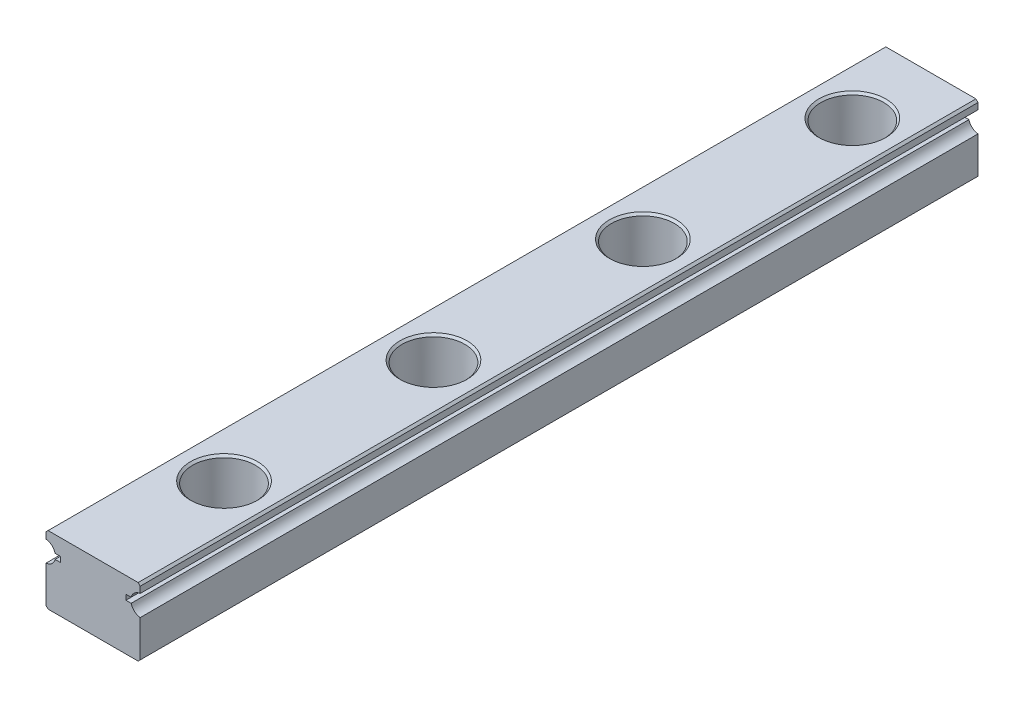
ISO-10303-21;
HEADER;
FILE_DESCRIPTION(('STEP AP214'),'2;1');
FILE_NAME('part.step','',(''),(''),'','','');
FILE_SCHEMA(('AUTOMOTIVE_DESIGN { 1 0 10303 214 1 1 1 1 }'));
ENDSEC;
DATA;
#1=APPLICATION_CONTEXT('core data for automotive mechanical design processes');
#2=APPLICATION_PROTOCOL_DEFINITION('international standard','automotive_design',2000,#1);
#3=PRODUCT_CONTEXT('',#1,'mechanical');
#4=PRODUCT('Part','Part','',(#3));
#5=PRODUCT_RELATED_PRODUCT_CATEGORY('part','',(#4));
#6=PRODUCT_DEFINITION_FORMATION('','',#4);
#7=PRODUCT_DEFINITION_CONTEXT('part definition',#1,'design');
#8=PRODUCT_DEFINITION('design','',#6,#7);
#9=PRODUCT_DEFINITION_SHAPE('','',#8);
#10=(LENGTH_UNIT() NAMED_UNIT(*) SI_UNIT(.MILLI.,.METRE.));
#11=(NAMED_UNIT(*) PLANE_ANGLE_UNIT() SI_UNIT($,.RADIAN.));
#12=(NAMED_UNIT(*) SI_UNIT($,.STERADIAN.) SOLID_ANGLE_UNIT());
#13=UNCERTAINTY_MEASURE_WITH_UNIT(LENGTH_MEASURE(1.E-05),#10,'distance_accuracy_value','');
#14=(GEOMETRIC_REPRESENTATION_CONTEXT(3) GLOBAL_UNCERTAINTY_ASSIGNED_CONTEXT((#13)) GLOBAL_UNIT_ASSIGNED_CONTEXT((#10,
#11,#12)) REPRESENTATION_CONTEXT('',''));
#15=CARTESIAN_POINT('',(0.,0.,0.));
#16=DIRECTION('',(0.,0.,1.));
#17=DIRECTION('',(1.,0.,0.));
#18=AXIS2_PLACEMENT_3D('',#15,#16,#17);
#19=CARTESIAN_POINT('',(-4.6,1.45,80.));
#20=DIRECTION('',(0.,0.,-1.));
#21=DIRECTION('',(-1.,0.,0.));
#22=AXIS2_PLACEMENT_3D('',#19,#20,#21);
#23=CYLINDRICAL_SURFACE('',#22,1.);
#24=CARTESIAN_POINT('',(-4.6,1.45,0.));
#25=DIRECTION('',(0.,0.,-1.));
#26=DIRECTION('',(-1.,0.,0.));
#27=AXIS2_PLACEMENT_3D('',#24,#25,#26);
#28=CIRCLE('',#27,1.);
#29=CARTESIAN_POINT('',(-4.5,2.44498743710662,0.));
#30=VERTEX_POINT('',#29);
#31=CARTESIAN_POINT('',(-3.63175416344814,1.7,0.));
#32=VERTEX_POINT('',#31);
#33=EDGE_CURVE('E214',#30,#32,#28,.T.);
#34=ORIENTED_EDGE('',*,*,#33,.T.);
#35=DIRECTION('',(0.,0.,-1.));
#36=VECTOR('',#35,1.);
#37=CARTESIAN_POINT('',(-3.63175416344814,1.7,80.));
#38=LINE('',#37,#36);
#39=CARTESIAN_POINT('',(-3.63175416344814,1.7,80.));
#40=VERTEX_POINT('',#39);
#41=EDGE_CURVE('E340',#40,#32,#38,.T.);
#42=ORIENTED_EDGE('',*,*,#41,.F.);
#43=CARTESIAN_POINT('',(-4.6,1.45,80.));
#44=DIRECTION('',(0.,0.,-1.));
#45=DIRECTION('',(-1.,0.,0.));
#46=AXIS2_PLACEMENT_3D('',#43,#44,#45);
#47=CIRCLE('',#46,1.);
#48=CARTESIAN_POINT('',(-4.5,2.44498743710662,80.));
#49=VERTEX_POINT('',#48);
#50=EDGE_CURVE('E273',#49,#40,#47,.T.);
#51=ORIENTED_EDGE('',*,*,#50,.F.);
#52=DIRECTION('',(0.,0.,-1.));
#53=VECTOR('',#52,1.);
#54=CARTESIAN_POINT('',(-4.5,2.44498743710662,80.));
#55=LINE('',#54,#53);
#56=EDGE_CURVE('E210',#49,#30,#55,.T.);
#57=ORIENTED_EDGE('',*,*,#56,.T.);
#58=EDGE_LOOP('',(#34,#42,#51,#57));
#59=FACE_BOUND('',#58,.T.);
#60=ADVANCED_FACE('F39',(#59),#23,.F.);
#61=CARTESIAN_POINT('',(-3.63175416344814,1.7,80.));
#62=DIRECTION('',(0.,1.,0.));
#63=DIRECTION('',(0.,0.,1.));
#64=AXIS2_PLACEMENT_3D('',#61,#62,#63);
#65=PLANE('',#64);
#66=DIRECTION('',(1.,0.,0.));
#67=VECTOR('',#66,1.);
#68=CARTESIAN_POINT('',(-3.63175416344814,1.7,0.));
#69=LINE('',#68,#67);
#70=CARTESIAN_POINT('',(-3.13175416344814,1.7,0.));
#71=VERTEX_POINT('',#70);
#72=EDGE_CURVE('E218',#32,#71,#69,.T.);
#73=ORIENTED_EDGE('',*,*,#72,.T.);
#74=DIRECTION('',(0.,0.,-1.));
#75=VECTOR('',#74,1.);
#76=CARTESIAN_POINT('',(-3.13175416344814,1.7,80.));
#77=LINE('',#76,#75);
#78=CARTESIAN_POINT('',(-3.13175416344814,1.7,80.));
#79=VERTEX_POINT('',#78);
#80=EDGE_CURVE('E336',#79,#71,#77,.T.);
#81=ORIENTED_EDGE('',*,*,#80,.F.);
#82=DIRECTION('',(1.,0.,0.));
#83=VECTOR('',#82,1.);
#84=CARTESIAN_POINT('',(-3.63175416344814,1.7,80.));
#85=LINE('',#84,#83);
#86=EDGE_CURVE('E137',#40,#79,#85,.T.);
#87=ORIENTED_EDGE('',*,*,#86,.F.);
#88=ORIENTED_EDGE('',*,*,#41,.T.);
#89=EDGE_LOOP('',(#73,#81,#87,#88));
#90=FACE_BOUND('',#89,.T.);
#91=ADVANCED_FACE('F415',(#90),#65,.F.);
#92=CARTESIAN_POINT('',(-3.13175416344814,1.2,80.));
#93=DIRECTION('',(1.,0.,0.));
#94=DIRECTION('',(0.,0.,-1.));
#95=AXIS2_PLACEMENT_3D('',#92,#93,#94);
#96=PLANE('',#95);
#97=DIRECTION('',(0.,-1.,0.));
#98=VECTOR('',#97,1.);
#99=CARTESIAN_POINT('',(-3.13175416344814,1.2,0.));
#100=LINE('',#99,#98);
#101=CARTESIAN_POINT('',(-3.13175416344814,1.2,0.));
#102=VERTEX_POINT('',#101);
#103=EDGE_CURVE('E222',#71,#102,#100,.T.);
#104=ORIENTED_EDGE('',*,*,#103,.T.);
#105=DIRECTION('',(0.,0.,-1.));
#106=VECTOR('',#105,1.);
#107=CARTESIAN_POINT('',(-3.13175416344814,1.2,80.));
#108=LINE('',#107,#106);
#109=CARTESIAN_POINT('',(-3.13175416344814,1.2,80.));
#110=VERTEX_POINT('',#109);
#111=EDGE_CURVE('E332',#110,#102,#108,.T.);
#112=ORIENTED_EDGE('',*,*,#111,.F.);
#113=DIRECTION('',(0.,-1.,0.));
#114=VECTOR('',#113,1.);
#115=CARTESIAN_POINT('',(-3.13175416344814,1.2,80.));
#116=LINE('',#115,#114);
#117=EDGE_CURVE('E497',#79,#110,#116,.T.);
#118=ORIENTED_EDGE('',*,*,#117,.F.);
#119=ORIENTED_EDGE('',*,*,#80,.T.);
#120=EDGE_LOOP('',(#104,#112,#118,#119));
#121=FACE_BOUND('',#120,.T.);
#122=ADVANCED_FACE('F421',(#121),#96,.F.);
#123=CARTESIAN_POINT('',(-3.63175416344814,1.2,80.));
#124=DIRECTION('',(0.,-1.,0.));
#125=DIRECTION('',(0.,0.,-1.));
#126=AXIS2_PLACEMENT_3D('',#123,#124,#125);
#127=PLANE('',#126);
#128=DIRECTION('',(-1.,0.,0.));
#129=VECTOR('',#128,1.);
#130=CARTESIAN_POINT('',(-3.63175416344814,1.2,0.));
#131=LINE('',#130,#129);
#132=CARTESIAN_POINT('',(-3.63175416344815,1.2,0.));
#133=VERTEX_POINT('',#132);
#134=EDGE_CURVE('E225',#102,#133,#131,.T.);
#135=ORIENTED_EDGE('',*,*,#134,.T.);
#136=DIRECTION('',(0.,0.,-1.));
#137=VECTOR('',#136,1.);
#138=CARTESIAN_POINT('',(-3.63175416344815,1.2,80.));
#139=LINE('',#138,#137);
#140=CARTESIAN_POINT('',(-3.63175416344815,1.2,80.));
#141=VERTEX_POINT('',#140);
#142=EDGE_CURVE('E328',#141,#133,#139,.T.);
#143=ORIENTED_EDGE('',*,*,#142,.F.);
#144=DIRECTION('',(-1.,0.,0.));
#145=VECTOR('',#144,1.);
#146=CARTESIAN_POINT('',(-3.63175416344814,1.2,80.));
#147=LINE('',#146,#145);
#148=EDGE_CURVE('E500',#110,#141,#147,.T.);
#149=ORIENTED_EDGE('',*,*,#148,.F.);
#150=ORIENTED_EDGE('',*,*,#111,.T.);
#151=EDGE_LOOP('',(#135,#143,#149,#150));
#152=FACE_BOUND('',#151,.T.);
#153=ADVANCED_FACE('F616',(#152),#127,.F.);
#154=CARTESIAN_POINT('',(-4.6,1.45,80.));
#155=DIRECTION('',(0.,0.,-1.));
#156=DIRECTION('',(-1.,0.,0.));
#157=AXIS2_PLACEMENT_3D('',#154,#155,#156);
#158=CYLINDRICAL_SURFACE('',#157,1.);
#159=CARTESIAN_POINT('',(-4.6,1.45,0.));
#160=DIRECTION('',(0.,0.,-1.));
#161=DIRECTION('',(-1.,0.,0.));
#162=AXIS2_PLACEMENT_3D('',#159,#160,#161);
#163=CIRCLE('',#162,1.);
#164=CARTESIAN_POINT('',(-4.5,0.455012562893381,0.));
#165=VERTEX_POINT('',#164);
#166=EDGE_CURVE('E228',#133,#165,#163,.T.);
#167=ORIENTED_EDGE('',*,*,#166,.T.);
#168=DIRECTION('',(0.,0.,-1.));
#169=VECTOR('',#168,1.);
#170=CARTESIAN_POINT('',(-4.5,0.455012562893381,80.));
#171=LINE('',#170,#169);
#172=CARTESIAN_POINT('',(-4.5,0.455012562893381,80.));
#173=VERTEX_POINT('',#172);
#174=EDGE_CURVE('E324',#173,#165,#171,.T.);
#175=ORIENTED_EDGE('',*,*,#174,.F.);
#176=CARTESIAN_POINT('',(-4.6,1.45,80.));
#177=DIRECTION('',(0.,0.,-1.));
#178=DIRECTION('',(-1.,0.,0.));
#179=AXIS2_PLACEMENT_3D('',#176,#177,#178);
#180=CIRCLE('',#179,1.);
#181=EDGE_CURVE('E503',#141,#173,#180,.T.);
#182=ORIENTED_EDGE('',*,*,#181,.F.);
#183=ORIENTED_EDGE('',*,*,#142,.T.);
#184=EDGE_LOOP('',(#167,#175,#182,#183));
#185=FACE_BOUND('',#184,.T.);
#186=ADVANCED_FACE('F612',(#185),#158,.F.);
#187=CARTESIAN_POINT('',(-4.5,-3.05,80.));
#188=DIRECTION('',(1.,0.,0.));
#189=DIRECTION('',(0.,1.,0.));
#190=AXIS2_PLACEMENT_3D('',#187,#188,#189);
#191=PLANE('',#190);
#192=DIRECTION('',(0.,-1.,0.));
#193=VECTOR('',#192,1.);
#194=CARTESIAN_POINT('',(-4.5,-3.05,0.));
#195=LINE('',#194,#193);
#196=CARTESIAN_POINT('',(-4.5,-3.05,0.));
#197=VERTEX_POINT('',#196);
#198=EDGE_CURVE('E231',#165,#197,#195,.T.);
#199=ORIENTED_EDGE('',*,*,#198,.T.);
#200=DIRECTION('',(0.,0.,-1.));
#201=VECTOR('',#200,1.);
#202=CARTESIAN_POINT('',(-4.5,-3.05,80.));
#203=LINE('',#202,#201);
#204=CARTESIAN_POINT('',(-4.5,-3.05,80.));
#205=VERTEX_POINT('',#204);
#206=EDGE_CURVE('E320',#205,#197,#203,.T.);
#207=ORIENTED_EDGE('',*,*,#206,.F.);
#208=DIRECTION('',(0.,-1.,0.));
#209=VECTOR('',#208,1.);
#210=CARTESIAN_POINT('',(-4.5,-3.05,80.));
#211=LINE('',#210,#209);
#212=EDGE_CURVE('E506',#173,#205,#211,.T.);
#213=ORIENTED_EDGE('',*,*,#212,.F.);
#214=ORIENTED_EDGE('',*,*,#174,.T.);
#215=EDGE_LOOP('',(#199,#207,#213,#214));
#216=FACE_BOUND('',#215,.T.);
#217=ADVANCED_FACE('F608',(#216),#191,.F.);
#218=CARTESIAN_POINT('',(-4.5,-3.05,80.));
#219=DIRECTION('',(0.707106781186549,0.707106781186546,0.));
#220=DIRECTION('',(-0.707106781186546,0.707106781186549,0.));
#221=AXIS2_PLACEMENT_3D('',#218,#219,#220);
#222=PLANE('',#221);
#223=DIRECTION('',(0.707106781186546,-0.707106781186549,0.));
#224=VECTOR('',#223,1.);
#225=CARTESIAN_POINT('',(-4.5,-3.05,0.));
#226=LINE('',#225,#224);
#227=CARTESIAN_POINT('',(-4.3,-3.25,0.));
#228=VERTEX_POINT('',#227);
#229=EDGE_CURVE('E234',#197,#228,#226,.T.);
#230=ORIENTED_EDGE('',*,*,#229,.T.);
#231=DIRECTION('',(0.,0.,-1.));
#232=VECTOR('',#231,1.);
#233=CARTESIAN_POINT('',(-4.3,-3.25,80.));
#234=LINE('',#233,#232);
#235=CARTESIAN_POINT('',(-4.3,-3.25,80.));
#236=VERTEX_POINT('',#235);
#237=EDGE_CURVE('E316',#236,#228,#234,.T.);
#238=ORIENTED_EDGE('',*,*,#237,.F.);
#239=DIRECTION('',(0.707106781186546,-0.707106781186549,0.));
#240=VECTOR('',#239,1.);
#241=CARTESIAN_POINT('',(-4.5,-3.05,80.));
#242=LINE('',#241,#240);
#243=EDGE_CURVE('E509',#205,#236,#242,.T.);
#244=ORIENTED_EDGE('',*,*,#243,.F.);
#245=ORIENTED_EDGE('',*,*,#206,.T.);
#246=EDGE_LOOP('',(#230,#238,#244,#245));
#247=FACE_BOUND('',#246,.T.);
#248=ADVANCED_FACE('F604',(#247),#222,.F.);
#249=CARTESIAN_POINT('',(-4.3,-3.25,80.));
#250=DIRECTION('',(0.,1.,0.));
#251=DIRECTION('',(0.,0.,1.));
#252=AXIS2_PLACEMENT_3D('',#249,#250,#251);
#253=PLANE('',#252);
#254=CARTESIAN_POINT('',(0.,-3.25,67.5));
#255=DIRECTION('',(0.,1.,0.));
#256=DIRECTION('',(0.,0.,1.));
#257=AXIS2_PLACEMENT_3D('',#254,#255,#256);
#258=CIRCLE('',#257,1.95000000000001);
#259=CARTESIAN_POINT('',(0.,-3.25,69.45));
#260=VERTEX_POINT('',#259);
#261=EDGE_CURVE('E391',#260,#260,#258,.T.);
#262=ORIENTED_EDGE('',*,*,#261,.T.);
#263=EDGE_LOOP('',(#262));
#264=FACE_BOUND('',#263,.T.);
#265=CARTESIAN_POINT('',(0.,-3.25,47.5));
#266=DIRECTION('',(0.,1.,0.));
#267=DIRECTION('',(0.,0.,1.));
#268=AXIS2_PLACEMENT_3D('',#265,#266,#267);
#269=CIRCLE('',#268,1.94999999999999);
#270=CARTESIAN_POINT('',(0.,-3.25,49.45));
#271=VERTEX_POINT('',#270);
#272=EDGE_CURVE('E375',#271,#271,#269,.T.);
#273=ORIENTED_EDGE('',*,*,#272,.T.);
#274=EDGE_LOOP('',(#273));
#275=FACE_BOUND('',#274,.T.);
#276=CARTESIAN_POINT('',(0.,-3.25,27.5));
#277=DIRECTION('',(0.,1.,0.));
#278=DIRECTION('',(0.,0.,1.));
#279=AXIS2_PLACEMENT_3D('',#276,#277,#278);
#280=CIRCLE('',#279,1.94999999999999);
#281=CARTESIAN_POINT('',(0.,-3.25,29.45));
#282=VERTEX_POINT('',#281);
#283=EDGE_CURVE('E359',#282,#282,#280,.T.);
#284=ORIENTED_EDGE('',*,*,#283,.T.);
#285=EDGE_LOOP('',(#284));
#286=FACE_BOUND('',#285,.T.);
#287=CARTESIAN_POINT('',(0.,-3.25,7.5));
#288=DIRECTION('',(0.,1.,0.));
#289=DIRECTION('',(0.,0.,1.));
#290=AXIS2_PLACEMENT_3D('',#287,#288,#289);
#291=CIRCLE('',#290,1.95);
#292=CARTESIAN_POINT('',(0.,-3.25,9.45));
#293=VERTEX_POINT('',#292);
#294=EDGE_CURVE('E343',#293,#293,#291,.T.);
#295=ORIENTED_EDGE('',*,*,#294,.T.);
#296=EDGE_LOOP('',(#295));
#297=FACE_BOUND('',#296,.T.);
#298=DIRECTION('',(1.,0.,0.));
#299=VECTOR('',#298,1.);
#300=CARTESIAN_POINT('',(-4.3,-3.25,0.));
#301=LINE('',#300,#299);
#302=CARTESIAN_POINT('',(4.3,-3.25,0.));
#303=VERTEX_POINT('',#302);
#304=EDGE_CURVE('E237',#228,#303,#301,.T.);
#305=ORIENTED_EDGE('',*,*,#304,.T.);
#306=DIRECTION('',(0.,0.,-1.));
#307=VECTOR('',#306,1.);
#308=CARTESIAN_POINT('',(4.3,-3.25,80.));
#309=LINE('',#308,#307);
#310=CARTESIAN_POINT('',(4.3,-3.25,80.));
#311=VERTEX_POINT('',#310);
#312=EDGE_CURVE('E312',#311,#303,#309,.T.);
#313=ORIENTED_EDGE('',*,*,#312,.F.);
#314=DIRECTION('',(1.,0.,0.));
#315=VECTOR('',#314,1.);
#316=CARTESIAN_POINT('',(-4.3,-3.25,80.));
#317=LINE('',#316,#315);
#318=EDGE_CURVE('E512',#236,#311,#317,.T.);
#319=ORIENTED_EDGE('',*,*,#318,.F.);
#320=ORIENTED_EDGE('',*,*,#237,.T.);
#321=EDGE_LOOP('',(#305,#313,#319,#320));
#322=FACE_BOUND('',#321,.T.);
#323=ADVANCED_FACE('F600',(#264,#275,#286,#297,#322),#253,.F.);
#324=CARTESIAN_POINT('',(4.3,-3.25,80.));
#325=DIRECTION('',(-0.707106781186547,0.707106781186548,0.));
#326=DIRECTION('',(-0.707106781186548,-0.707106781186547,0.));
#327=AXIS2_PLACEMENT_3D('',#324,#325,#326);
#328=PLANE('',#327);
#329=DIRECTION('',(0.707106781186548,0.707106781186547,0.));
#330=VECTOR('',#329,1.);
#331=CARTESIAN_POINT('',(4.3,-3.25,0.));
#332=LINE('',#331,#330);
#333=CARTESIAN_POINT('',(4.5,-3.05,0.));
#334=VERTEX_POINT('',#333);
#335=EDGE_CURVE('E240',#303,#334,#332,.T.);
#336=ORIENTED_EDGE('',*,*,#335,.T.);
#337=DIRECTION('',(0.,0.,-1.));
#338=VECTOR('',#337,1.);
#339=CARTESIAN_POINT('',(4.5,-3.05,80.));
#340=LINE('',#339,#338);
#341=CARTESIAN_POINT('',(4.5,-3.05,80.));
#342=VERTEX_POINT('',#341);
#343=EDGE_CURVE('E308',#342,#334,#340,.T.);
#344=ORIENTED_EDGE('',*,*,#343,.F.);
#345=DIRECTION('',(0.707106781186548,0.707106781186547,0.));
#346=VECTOR('',#345,1.);
#347=CARTESIAN_POINT('',(4.3,-3.25,80.));
#348=LINE('',#347,#346);
#349=EDGE_CURVE('E515',#311,#342,#348,.T.);
#350=ORIENTED_EDGE('',*,*,#349,.F.);
#351=ORIENTED_EDGE('',*,*,#312,.T.);
#352=EDGE_LOOP('',(#336,#344,#350,#351));
#353=FACE_BOUND('',#352,.T.);
#354=ADVANCED_FACE('F596',(#353),#328,.F.);
#355=CARTESIAN_POINT('',(4.5,-3.05,80.));
#356=DIRECTION('',(-1.,0.,0.));
#357=DIRECTION('',(0.,-1.,0.));
#358=AXIS2_PLACEMENT_3D('',#355,#356,#357);
#359=PLANE('',#358);
#360=DIRECTION('',(0.,1.,0.));
#361=VECTOR('',#360,1.);
#362=CARTESIAN_POINT('',(4.5,-3.05,0.));
#363=LINE('',#362,#361);
#364=CARTESIAN_POINT('',(4.5,0.45501256289338,0.));
#365=VERTEX_POINT('',#364);
#366=EDGE_CURVE('E243',#334,#365,#363,.T.);
#367=ORIENTED_EDGE('',*,*,#366,.T.);
#368=DIRECTION('',(0.,0.,-1.));
#369=VECTOR('',#368,1.);
#370=CARTESIAN_POINT('',(4.5,0.45501256289338,80.));
#371=LINE('',#370,#369);
#372=CARTESIAN_POINT('',(4.5,0.45501256289338,80.));
#373=VERTEX_POINT('',#372);
#374=EDGE_CURVE('E304',#373,#365,#371,.T.);
#375=ORIENTED_EDGE('',*,*,#374,.F.);
#376=DIRECTION('',(0.,1.,0.));
#377=VECTOR('',#376,1.);
#378=CARTESIAN_POINT('',(4.5,-3.05,80.));
#379=LINE('',#378,#377);
#380=EDGE_CURVE('E518',#342,#373,#379,.T.);
#381=ORIENTED_EDGE('',*,*,#380,.F.);
#382=ORIENTED_EDGE('',*,*,#343,.T.);
#383=EDGE_LOOP('',(#367,#375,#381,#382));
#384=FACE_BOUND('',#383,.T.);
#385=ADVANCED_FACE('F592',(#384),#359,.F.);
#386=CARTESIAN_POINT('',(4.6,1.45,80.));
#387=DIRECTION('',(0.,0.,-1.));
#388=DIRECTION('',(-1.,0.,0.));
#389=AXIS2_PLACEMENT_3D('',#386,#387,#388);
#390=CYLINDRICAL_SURFACE('',#389,1.);
#391=CARTESIAN_POINT('',(4.6,1.45,0.));
#392=DIRECTION('',(0.,0.,-1.));
#393=DIRECTION('',(1.,0.,0.));
#394=AXIS2_PLACEMENT_3D('',#391,#392,#393);
#395=CIRCLE('',#394,1.);
#396=CARTESIAN_POINT('',(3.63175416344814,1.2,0.));
#397=VERTEX_POINT('',#396);
#398=EDGE_CURVE('E246',#365,#397,#395,.T.);
#399=ORIENTED_EDGE('',*,*,#398,.T.);
#400=DIRECTION('',(0.,0.,-1.));
#401=VECTOR('',#400,1.);
#402=CARTESIAN_POINT('',(3.63175416344814,1.2,80.));
#403=LINE('',#402,#401);
#404=CARTESIAN_POINT('',(3.63175416344814,1.2,80.));
#405=VERTEX_POINT('',#404);
#406=EDGE_CURVE('E300',#405,#397,#403,.T.);
#407=ORIENTED_EDGE('',*,*,#406,.F.);
#408=CARTESIAN_POINT('',(4.6,1.45,80.));
#409=DIRECTION('',(0.,0.,-1.));
#410=DIRECTION('',(1.,0.,0.));
#411=AXIS2_PLACEMENT_3D('',#408,#409,#410);
#412=CIRCLE('',#411,1.);
#413=EDGE_CURVE('E521',#373,#405,#412,.T.);
#414=ORIENTED_EDGE('',*,*,#413,.F.);
#415=ORIENTED_EDGE('',*,*,#374,.T.);
#416=EDGE_LOOP('',(#399,#407,#414,#415));
#417=FACE_BOUND('',#416,.T.);
#418=ADVANCED_FACE('F588',(#417),#390,.F.);
#419=CARTESIAN_POINT('',(3.63175416344814,1.2,80.));
#420=DIRECTION('',(0.,-1.,0.));
#421=DIRECTION('',(0.,0.,-1.));
#422=AXIS2_PLACEMENT_3D('',#419,#420,#421);
#423=PLANE('',#422);
#424=DIRECTION('',(-1.,0.,0.));
#425=VECTOR('',#424,1.);
#426=CARTESIAN_POINT('',(3.63175416344814,1.2,0.));
#427=LINE('',#426,#425);
#428=CARTESIAN_POINT('',(3.13175416344814,1.2,0.));
#429=VERTEX_POINT('',#428);
#430=EDGE_CURVE('E249',#397,#429,#427,.T.);
#431=ORIENTED_EDGE('',*,*,#430,.T.);
#432=DIRECTION('',(0.,0.,-1.));
#433=VECTOR('',#432,1.);
#434=CARTESIAN_POINT('',(3.13175416344814,1.2,80.));
#435=LINE('',#434,#433);
#436=CARTESIAN_POINT('',(3.13175416344814,1.2,80.));
#437=VERTEX_POINT('',#436);
#438=EDGE_CURVE('E296',#437,#429,#435,.T.);
#439=ORIENTED_EDGE('',*,*,#438,.F.);
#440=DIRECTION('',(-1.,0.,0.));
#441=VECTOR('',#440,1.);
#442=CARTESIAN_POINT('',(3.63175416344814,1.2,80.));
#443=LINE('',#442,#441);
#444=EDGE_CURVE('E524',#405,#437,#443,.T.);
#445=ORIENTED_EDGE('',*,*,#444,.F.);
#446=ORIENTED_EDGE('',*,*,#406,.T.);
#447=EDGE_LOOP('',(#431,#439,#445,#446));
#448=FACE_BOUND('',#447,.T.);
#449=ADVANCED_FACE('F584',(#448),#423,.F.);
#450=CARTESIAN_POINT('',(3.13175416344814,1.2,80.));
#451=DIRECTION('',(-1.,0.,0.));
#452=DIRECTION('',(0.,0.,1.));
#453=AXIS2_PLACEMENT_3D('',#450,#451,#452);
#454=PLANE('',#453);
#455=DIRECTION('',(0.,1.,0.));
#456=VECTOR('',#455,1.);
#457=CARTESIAN_POINT('',(3.13175416344814,1.2,0.));
#458=LINE('',#457,#456);
#459=CARTESIAN_POINT('',(3.13175416344814,1.7,0.));
#460=VERTEX_POINT('',#459);
#461=EDGE_CURVE('E252',#429,#460,#458,.T.);
#462=ORIENTED_EDGE('',*,*,#461,.T.);
#463=DIRECTION('',(0.,0.,-1.));
#464=VECTOR('',#463,1.);
#465=CARTESIAN_POINT('',(3.13175416344814,1.7,80.));
#466=LINE('',#465,#464);
#467=CARTESIAN_POINT('',(3.13175416344814,1.7,80.));
#468=VERTEX_POINT('',#467);
#469=EDGE_CURVE('E292',#468,#460,#466,.T.);
#470=ORIENTED_EDGE('',*,*,#469,.F.);
#471=DIRECTION('',(0.,1.,0.));
#472=VECTOR('',#471,1.);
#473=CARTESIAN_POINT('',(3.13175416344814,1.2,80.));
#474=LINE('',#473,#472);
#475=EDGE_CURVE('E527',#437,#468,#474,.T.);
#476=ORIENTED_EDGE('',*,*,#475,.F.);
#477=ORIENTED_EDGE('',*,*,#438,.T.);
#478=EDGE_LOOP('',(#462,#470,#476,#477));
#479=FACE_BOUND('',#478,.T.);
#480=ADVANCED_FACE('F580',(#479),#454,.F.);
#481=CARTESIAN_POINT('',(3.63175416344814,1.7,80.));
#482=DIRECTION('',(0.,1.,0.));
#483=DIRECTION('',(0.,0.,1.));
#484=AXIS2_PLACEMENT_3D('',#481,#482,#483);
#485=PLANE('',#484);
#486=DIRECTION('',(1.,0.,0.));
#487=VECTOR('',#486,1.);
#488=CARTESIAN_POINT('',(3.63175416344814,1.7,0.));
#489=LINE('',#488,#487);
#490=CARTESIAN_POINT('',(3.63175416344815,1.7,0.));
#491=VERTEX_POINT('',#490);
#492=EDGE_CURVE('E255',#460,#491,#489,.T.);
#493=ORIENTED_EDGE('',*,*,#492,.T.);
#494=DIRECTION('',(0.,0.,-1.));
#495=VECTOR('',#494,1.);
#496=CARTESIAN_POINT('',(3.63175416344815,1.7,80.));
#497=LINE('',#496,#495);
#498=CARTESIAN_POINT('',(3.63175416344815,1.7,80.));
#499=VERTEX_POINT('',#498);
#500=EDGE_CURVE('E288',#499,#491,#497,.T.);
#501=ORIENTED_EDGE('',*,*,#500,.F.);
#502=DIRECTION('',(1.,0.,0.));
#503=VECTOR('',#502,1.);
#504=CARTESIAN_POINT('',(3.63175416344814,1.7,80.));
#505=LINE('',#504,#503);
#506=EDGE_CURVE('E530',#468,#499,#505,.T.);
#507=ORIENTED_EDGE('',*,*,#506,.F.);
#508=ORIENTED_EDGE('',*,*,#469,.T.);
#509=EDGE_LOOP('',(#493,#501,#507,#508));
#510=FACE_BOUND('',#509,.T.);
#511=ADVANCED_FACE('F576',(#510),#485,.F.);
#512=CARTESIAN_POINT('',(4.6,1.45,80.));
#513=DIRECTION('',(0.,0.,-1.));
#514=DIRECTION('',(-1.,0.,0.));
#515=AXIS2_PLACEMENT_3D('',#512,#513,#514);
#516=CYLINDRICAL_SURFACE('',#515,1.);
#517=CARTESIAN_POINT('',(4.6,1.45,0.));
#518=DIRECTION('',(0.,0.,-1.));
#519=DIRECTION('',(1.,0.,0.));
#520=AXIS2_PLACEMENT_3D('',#517,#518,#519);
#521=CIRCLE('',#520,1.);
#522=CARTESIAN_POINT('',(4.5,2.44498743710662,0.));
#523=VERTEX_POINT('',#522);
#524=EDGE_CURVE('E258',#491,#523,#521,.T.);
#525=ORIENTED_EDGE('',*,*,#524,.T.);
#526=DIRECTION('',(0.,0.,-1.));
#527=VECTOR('',#526,1.);
#528=CARTESIAN_POINT('',(4.5,2.44498743710662,80.));
#529=LINE('',#528,#527);
#530=CARTESIAN_POINT('',(4.5,2.44498743710662,80.));
#531=VERTEX_POINT('',#530);
#532=EDGE_CURVE('E284',#531,#523,#529,.T.);
#533=ORIENTED_EDGE('',*,*,#532,.F.);
#534=CARTESIAN_POINT('',(4.6,1.45,80.));
#535=DIRECTION('',(0.,0.,-1.));
#536=DIRECTION('',(1.,0.,0.));
#537=AXIS2_PLACEMENT_3D('',#534,#535,#536);
#538=CIRCLE('',#537,1.);
#539=EDGE_CURVE('E533',#499,#531,#538,.T.);
#540=ORIENTED_EDGE('',*,*,#539,.F.);
#541=ORIENTED_EDGE('',*,*,#500,.T.);
#542=EDGE_LOOP('',(#525,#533,#540,#541));
#543=FACE_BOUND('',#542,.T.);
#544=ADVANCED_FACE('F573',(#543),#516,.F.);
#545=CARTESIAN_POINT('',(4.5,2.44498743710662,80.));
#546=DIRECTION('',(-1.,0.,0.));
#547=DIRECTION('',(0.,-1.,0.));
#548=AXIS2_PLACEMENT_3D('',#545,#546,#547);
#549=PLANE('',#548);
#550=DIRECTION('',(0.,1.,0.));
#551=VECTOR('',#550,1.);
#552=CARTESIAN_POINT('',(4.5,2.44498743710662,0.));
#553=LINE('',#552,#551);
#554=CARTESIAN_POINT('',(4.5,3.05,0.));
#555=VERTEX_POINT('',#554);
#556=EDGE_CURVE('E261',#523,#555,#553,.T.);
#557=ORIENTED_EDGE('',*,*,#556,.T.);
#558=DIRECTION('',(0.,0.,-1.));
#559=VECTOR('',#558,1.);
#560=CARTESIAN_POINT('',(4.5,3.05,80.));
#561=LINE('',#560,#559);
#562=CARTESIAN_POINT('',(4.5,3.05,80.));
#563=VERTEX_POINT('',#562);
#564=EDGE_CURVE('E280',#563,#555,#561,.T.);
#565=ORIENTED_EDGE('',*,*,#564,.F.);
#566=DIRECTION('',(0.,1.,0.));
#567=VECTOR('',#566,1.);
#568=CARTESIAN_POINT('',(4.5,2.44498743710662,80.));
#569=LINE('',#568,#567);
#570=EDGE_CURVE('E536',#531,#563,#569,.T.);
#571=ORIENTED_EDGE('',*,*,#570,.F.);
#572=ORIENTED_EDGE('',*,*,#532,.T.);
#573=EDGE_LOOP('',(#557,#565,#571,#572));
#574=FACE_BOUND('',#573,.T.);
#575=ADVANCED_FACE('F544',(#574),#549,.F.);
#576=CARTESIAN_POINT('',(4.3,3.25,80.));
#577=DIRECTION('',(-0.707106781186548,-0.707106781186548,0.));
#578=DIRECTION('',(0.707106781186548,-0.707106781186548,0.));
#579=AXIS2_PLACEMENT_3D('',#576,#577,#578);
#580=PLANE('',#579);
#581=DIRECTION('',(-0.707106781186547,0.707106781186547,0.));
#582=VECTOR('',#581,1.);
#583=CARTESIAN_POINT('',(4.3,3.25,0.));
#584=LINE('',#583,#582);
#585=CARTESIAN_POINT('',(4.3,3.25,0.));
#586=VERTEX_POINT('',#585);
#587=EDGE_CURVE('E264',#555,#586,#584,.T.);
#588=ORIENTED_EDGE('',*,*,#587,.T.);
#589=DIRECTION('',(0.,0.,-1.));
#590=VECTOR('',#589,1.);
#591=CARTESIAN_POINT('',(4.3,3.25,80.));
#592=LINE('',#591,#590);
#593=CARTESIAN_POINT('',(4.3,3.25,80.));
#594=VERTEX_POINT('',#593);
#595=EDGE_CURVE('E203',#594,#586,#592,.T.);
#596=ORIENTED_EDGE('',*,*,#595,.F.);
#597=DIRECTION('',(-0.707106781186547,0.707106781186547,0.));
#598=VECTOR('',#597,1.);
#599=CARTESIAN_POINT('',(4.3,3.25,80.));
#600=LINE('',#599,#598);
#601=EDGE_CURVE('E192',#563,#594,#600,.T.);
#602=ORIENTED_EDGE('',*,*,#601,.F.);
#603=ORIENTED_EDGE('',*,*,#564,.T.);
#604=EDGE_LOOP('',(#588,#596,#602,#603));
#605=FACE_BOUND('',#604,.T.);
#606=ADVANCED_FACE('F548',(#605),#580,.F.);
#607=CARTESIAN_POINT('',(-4.3,3.25,80.));
#608=DIRECTION('',(0.,-1.,0.));
#609=DIRECTION('',(0.,0.,-1.));
#610=AXIS2_PLACEMENT_3D('',#607,#608,#609);
#611=PLANE('',#610);
#612=CARTESIAN_POINT('',(0.,3.25,67.5));
#613=DIRECTION('',(0.,-1.,0.));
#614=DIRECTION('',(0.,0.,-1.));
#615=AXIS2_PLACEMENT_3D('',#612,#613,#614);
#616=CIRCLE('',#615,3.19999999999999);
#617=CARTESIAN_POINT('',(0.,3.25,64.3));
#618=VERTEX_POINT('',#617);
#619=EDGE_CURVE('E11',#618,#618,#616,.T.);
#620=ORIENTED_EDGE('',*,*,#619,.T.);
#621=EDGE_LOOP('',(#620));
#622=FACE_BOUND('',#621,.T.);
#623=CARTESIAN_POINT('',(0.,3.25,47.5));
#624=DIRECTION('',(0.,-1.,0.));
#625=DIRECTION('',(0.,0.,-1.));
#626=AXIS2_PLACEMENT_3D('',#623,#624,#625);
#627=CIRCLE('',#626,3.19999999999999);
#628=CARTESIAN_POINT('',(0.,3.25,44.3));
#629=VERTEX_POINT('',#628);
#630=EDGE_CURVE('E387',#629,#629,#627,.T.);
#631=ORIENTED_EDGE('',*,*,#630,.T.);
#632=EDGE_LOOP('',(#631));
#633=FACE_BOUND('',#632,.T.);
#634=CARTESIAN_POINT('',(0.,3.25,27.5));
#635=DIRECTION('',(0.,-1.,0.));
#636=DIRECTION('',(0.,0.,-1.));
#637=AXIS2_PLACEMENT_3D('',#634,#635,#636);
#638=CIRCLE('',#637,3.19999999999999);
#639=CARTESIAN_POINT('',(0.,3.25,24.3));
#640=VERTEX_POINT('',#639);
#641=EDGE_CURVE('E371',#640,#640,#638,.T.);
#642=ORIENTED_EDGE('',*,*,#641,.T.);
#643=EDGE_LOOP('',(#642));
#644=FACE_BOUND('',#643,.T.);
#645=CARTESIAN_POINT('',(0.,3.25,7.5));
#646=DIRECTION('',(0.,-1.,0.));
#647=DIRECTION('',(0.,0.,-1.));
#648=AXIS2_PLACEMENT_3D('',#645,#646,#647);
#649=CIRCLE('',#648,3.2);
#650=CARTESIAN_POINT('',(0.,3.25,4.30000000000001));
#651=VERTEX_POINT('',#650);
#652=EDGE_CURVE('E355',#651,#651,#649,.T.);
#653=ORIENTED_EDGE('',*,*,#652,.T.);
#654=EDGE_LOOP('',(#653));
#655=FACE_BOUND('',#654,.T.);
#656=DIRECTION('',(-1.,0.,0.));
#657=VECTOR('',#656,1.);
#658=CARTESIAN_POINT('',(-4.3,3.25,0.));
#659=LINE('',#658,#657);
#660=CARTESIAN_POINT('',(-4.3,3.25,0.));
#661=VERTEX_POINT('',#660);
#662=EDGE_CURVE('E201',#586,#661,#659,.T.);
#663=ORIENTED_EDGE('',*,*,#662,.T.);
#664=DIRECTION('',(0.,0.,-1.));
#665=VECTOR('',#664,1.);
#666=CARTESIAN_POINT('',(-4.3,3.25,80.));
#667=LINE('',#666,#665);
#668=CARTESIAN_POINT('',(-4.3,3.25,80.));
#669=VERTEX_POINT('',#668);
#670=EDGE_CURVE('E198',#669,#661,#667,.T.);
#671=ORIENTED_EDGE('',*,*,#670,.F.);
#672=DIRECTION('',(-1.,0.,0.));
#673=VECTOR('',#672,1.);
#674=CARTESIAN_POINT('',(-4.3,3.25,80.));
#675=LINE('',#674,#673);
#676=EDGE_CURVE('E186',#594,#669,#675,.T.);
#677=ORIENTED_EDGE('',*,*,#676,.F.);
#678=ORIENTED_EDGE('',*,*,#595,.T.);
#679=EDGE_LOOP('',(#663,#671,#677,#678));
#680=FACE_BOUND('',#679,.T.);
#681=ADVANCED_FACE('F199',(#622,#633,#644,#655,#680),#611,.F.);
#682=CARTESIAN_POINT('',(-4.5,3.05,80.));
#683=DIRECTION('',(0.707106781186548,-0.707106781186548,0.));
#684=DIRECTION('',(0.707106781186548,0.707106781186548,0.));
#685=AXIS2_PLACEMENT_3D('',#682,#683,#684);
#686=PLANE('',#685);
#687=DIRECTION('',(-0.707106781186547,-0.707106781186547,0.));
#688=VECTOR('',#687,1.);
#689=CARTESIAN_POINT('',(-4.5,3.05,0.));
#690=LINE('',#689,#688);
#691=CARTESIAN_POINT('',(-4.5,3.05,0.));
#692=VERTEX_POINT('',#691);
#693=EDGE_CURVE('E122',#661,#692,#690,.T.);
#694=ORIENTED_EDGE('',*,*,#693,.T.);
#695=DIRECTION('',(0.,0.,-1.));
#696=VECTOR('',#695,1.);
#697=CARTESIAN_POINT('',(-4.5,3.05,80.));
#698=LINE('',#697,#696);
#699=CARTESIAN_POINT('',(-4.5,3.05,80.));
#700=VERTEX_POINT('',#699);
#701=EDGE_CURVE('E204',#700,#692,#698,.T.);
#702=ORIENTED_EDGE('',*,*,#701,.F.);
#703=DIRECTION('',(-0.707106781186547,-0.707106781186547,0.));
#704=VECTOR('',#703,1.);
#705=CARTESIAN_POINT('',(-4.5,3.05,80.));
#706=LINE('',#705,#704);
#707=EDGE_CURVE('E190',#669,#700,#706,.T.);
#708=ORIENTED_EDGE('',*,*,#707,.F.);
#709=ORIENTED_EDGE('',*,*,#670,.T.);
#710=EDGE_LOOP('',(#694,#702,#708,#709));
#711=FACE_BOUND('',#710,.T.);
#712=ADVANCED_FACE('F206',(#711),#686,.F.);
#713=CARTESIAN_POINT('',(-4.5,2.44498743710662,80.));
#714=DIRECTION('',(1.,0.,0.));
#715=DIRECTION('',(0.,1.,0.));
#716=AXIS2_PLACEMENT_3D('',#713,#714,#715);
#717=PLANE('',#716);
#718=DIRECTION('',(0.,-1.,0.));
#719=VECTOR('',#718,1.);
#720=CARTESIAN_POINT('',(-4.5,2.44498743710662,0.));
#721=LINE('',#720,#719);
#722=EDGE_CURVE('E128',#692,#30,#721,.T.);
#723=ORIENTED_EDGE('',*,*,#722,.T.);
#724=ORIENTED_EDGE('',*,*,#56,.F.);
#725=DIRECTION('',(0.,-1.,0.));
#726=VECTOR('',#725,1.);
#727=CARTESIAN_POINT('',(-4.5,2.44498743710662,80.));
#728=LINE('',#727,#726);
#729=EDGE_CURVE('E57',#700,#49,#728,.T.);
#730=ORIENTED_EDGE('',*,*,#729,.F.);
#731=ORIENTED_EDGE('',*,*,#701,.T.);
#732=EDGE_LOOP('',(#723,#724,#730,#731));
#733=FACE_BOUND('',#732,.T.);
#734=ADVANCED_FACE('F555',(#733),#717,.F.);
#735=CARTESIAN_POINT('',(-4.6,1.45,80.));
#736=DIRECTION('',(0.,0.,-1.));
#737=DIRECTION('',(-1.,0.,0.));
#738=AXIS2_PLACEMENT_3D('',#735,#736,#737);
#739=PLANE('',#738);
#740=ORIENTED_EDGE('',*,*,#50,.T.);
#741=ORIENTED_EDGE('',*,*,#86,.T.);
#742=ORIENTED_EDGE('',*,*,#117,.T.);
#743=ORIENTED_EDGE('',*,*,#148,.T.);
#744=ORIENTED_EDGE('',*,*,#181,.T.);
#745=ORIENTED_EDGE('',*,*,#212,.T.);
#746=ORIENTED_EDGE('',*,*,#243,.T.);
#747=ORIENTED_EDGE('',*,*,#318,.T.);
#748=ORIENTED_EDGE('',*,*,#349,.T.);
#749=ORIENTED_EDGE('',*,*,#380,.T.);
#750=ORIENTED_EDGE('',*,*,#413,.T.);
#751=ORIENTED_EDGE('',*,*,#444,.T.);
#752=ORIENTED_EDGE('',*,*,#475,.T.);
#753=ORIENTED_EDGE('',*,*,#506,.T.);
#754=ORIENTED_EDGE('',*,*,#539,.T.);
#755=ORIENTED_EDGE('',*,*,#570,.T.);
#756=ORIENTED_EDGE('',*,*,#601,.T.);
#757=ORIENTED_EDGE('',*,*,#676,.T.);
#758=ORIENTED_EDGE('',*,*,#707,.T.);
#759=ORIENTED_EDGE('',*,*,#729,.T.);
#760=EDGE_LOOP('',(#740,#741,#742,#743,#744,#745,#746,#747,#748,#749,#750,#751,#752,#753,#754,
#755,#756,#757,#758,#759));
#761=FACE_BOUND('',#760,.T.);
#762=ADVANCED_FACE('F188',(#761),#739,.F.);
#763=CARTESIAN_POINT('',(-4.6,1.45,0.));
#764=DIRECTION('',(0.,0.,-1.));
#765=DIRECTION('',(-1.,0.,0.));
#766=AXIS2_PLACEMENT_3D('',#763,#764,#765);
#767=PLANE('',#766);
#768=ORIENTED_EDGE('',*,*,#33,.F.);
#769=ORIENTED_EDGE('',*,*,#722,.F.);
#770=ORIENTED_EDGE('',*,*,#693,.F.);
#771=ORIENTED_EDGE('',*,*,#662,.F.);
#772=ORIENTED_EDGE('',*,*,#587,.F.);
#773=ORIENTED_EDGE('',*,*,#556,.F.);
#774=ORIENTED_EDGE('',*,*,#524,.F.);
#775=ORIENTED_EDGE('',*,*,#492,.F.);
#776=ORIENTED_EDGE('',*,*,#461,.F.);
#777=ORIENTED_EDGE('',*,*,#430,.F.);
#778=ORIENTED_EDGE('',*,*,#398,.F.);
#779=ORIENTED_EDGE('',*,*,#366,.F.);
#780=ORIENTED_EDGE('',*,*,#335,.F.);
#781=ORIENTED_EDGE('',*,*,#304,.F.);
#782=ORIENTED_EDGE('',*,*,#229,.F.);
#783=ORIENTED_EDGE('',*,*,#198,.F.);
#784=ORIENTED_EDGE('',*,*,#166,.F.);
#785=ORIENTED_EDGE('',*,*,#134,.F.);
#786=ORIENTED_EDGE('',*,*,#103,.F.);
#787=ORIENTED_EDGE('',*,*,#72,.F.);
#788=EDGE_LOOP('',(#768,#769,#770,#771,#772,#773,#774,#775,#776,#777,#778,#779,#780,#781,#782,
#783,#784,#785,#786,#787));
#789=FACE_BOUND('',#788,.T.);
#790=ADVANCED_FACE('F551',(#789),#767,.T.);
#791=CARTESIAN_POINT('',(0.,3.25,7.5));
#792=DIRECTION('',(0.,1.,0.));
#793=DIRECTION('',(0.,0.,1.));
#794=AXIS2_PLACEMENT_3D('',#791,#792,#793);
#795=CYLINDRICAL_SURFACE('',#794,1.75);
#796=CARTESIAN_POINT('',(0.,-3.04999999999999,7.5));
#797=DIRECTION('',(0.,1.,0.));
#798=DIRECTION('',(0.,0.,1.));
#799=AXIS2_PLACEMENT_3D('',#796,#797,#798);
#800=CIRCLE('',#799,1.75);
#801=CARTESIAN_POINT('',(0.,-3.04999999999999,9.25));
#802=VERTEX_POINT('',#801);
#803=EDGE_CURVE('E347',#802,#802,#800,.F.);
#804=ORIENTED_EDGE('',*,*,#803,.T.);
#805=EDGE_LOOP('',(#804));
#806=FACE_BOUND('',#805,.T.);
#807=CARTESIAN_POINT('',(0.,-1.25,7.5));
#808=DIRECTION('',(0.,1.,0.));
#809=DIRECTION('',(0.,0.,1.));
#810=AXIS2_PLACEMENT_3D('',#807,#808,#809);
#811=CIRCLE('',#810,1.75);
#812=CARTESIAN_POINT('',(0.,-1.25,9.25));
#813=VERTEX_POINT('',#812);
#814=EDGE_CURVE('E219',#813,#813,#811,.T.);
#815=ORIENTED_EDGE('',*,*,#814,.T.);
#816=EDGE_LOOP('',(#815));
#817=FACE_BOUND('',#816,.T.);
#818=ADVANCED_FACE('F748',(#806,#817),#795,.F.);
#819=CARTESIAN_POINT('',(1.75,-1.25,7.5));
#820=DIRECTION('',(0.,-1.,0.));
#821=DIRECTION('',(0.,0.,-1.));
#822=AXIS2_PLACEMENT_3D('',#819,#820,#821);
#823=PLANE('',#822);
#824=ORIENTED_EDGE('',*,*,#814,.F.);
#825=EDGE_LOOP('',(#824));
#826=FACE_BOUND('',#825,.T.);
#827=CARTESIAN_POINT('',(0.,-1.25,7.5));
#828=DIRECTION('',(0.,1.,0.));
#829=DIRECTION('',(0.,0.,1.));
#830=AXIS2_PLACEMENT_3D('',#827,#828,#829);
#831=CIRCLE('',#830,3.);
#832=CARTESIAN_POINT('',(0.,-1.25,10.5));
#833=VERTEX_POINT('',#832);
#834=EDGE_CURVE('E486',#833,#833,#831,.T.);
#835=ORIENTED_EDGE('',*,*,#834,.T.);
#836=EDGE_LOOP('',(#835));
#837=FACE_BOUND('',#836,.T.);
#838=ADVANCED_FACE('F754',(#826,#837),#823,.F.);
#839=CARTESIAN_POINT('',(0.,3.25,7.5));
#840=DIRECTION('',(0.,1.,0.));
#841=DIRECTION('',(0.,0.,1.));
#842=AXIS2_PLACEMENT_3D('',#839,#840,#841);
#843=CYLINDRICAL_SURFACE('',#842,3.);
#844=CARTESIAN_POINT('',(0.,3.05,7.5));
#845=DIRECTION('',(0.,-1.,0.));
#846=DIRECTION('',(0.,0.,-1.));
#847=AXIS2_PLACEMENT_3D('',#844,#845,#846);
#848=CIRCLE('',#847,3.);
#849=CARTESIAN_POINT('',(0.,3.05,4.5));
#850=VERTEX_POINT('',#849);
#851=EDGE_CURVE('E351',#850,#850,#848,.F.);
#852=ORIENTED_EDGE('',*,*,#851,.T.);
#853=EDGE_LOOP('',(#852));
#854=FACE_BOUND('',#853,.T.);
#855=ORIENTED_EDGE('',*,*,#834,.F.);
#856=EDGE_LOOP('',(#855));
#857=FACE_BOUND('',#856,.T.);
#858=ADVANCED_FACE('F429',(#854,#857),#843,.F.);
#859=CARTESIAN_POINT('',(0.,-3.25,7.5));
#860=DIRECTION('',(0.,-1.,0.));
#861=DIRECTION('',(0.,0.,-1.));
#862=AXIS2_PLACEMENT_3D('',#859,#860,#861);
#863=CONICAL_SURFACE('',#862,1.95,0.785398163397438);
#864=ORIENTED_EDGE('',*,*,#803,.F.);
#865=EDGE_LOOP('',(#864));
#866=FACE_BOUND('',#865,.T.);
#867=ORIENTED_EDGE('',*,*,#294,.F.);
#868=EDGE_LOOP('',(#867));
#869=FACE_BOUND('',#868,.T.);
#870=ADVANCED_FACE('F425',(#866,#869),#863,.F.);
#871=CARTESIAN_POINT('',(0.,3.05,7.5));
#872=DIRECTION('',(0.,1.,0.));
#873=DIRECTION('',(0.,0.,1.));
#874=AXIS2_PLACEMENT_3D('',#871,#872,#873);
#875=CONICAL_SURFACE('',#874,3.,0.785398163397445);
#876=ORIENTED_EDGE('',*,*,#652,.F.);
#877=EDGE_LOOP('',(#876));
#878=FACE_BOUND('',#877,.T.);
#879=ORIENTED_EDGE('',*,*,#851,.F.);
#880=EDGE_LOOP('',(#879));
#881=FACE_BOUND('',#880,.T.);
#882=ADVANCED_FACE('F428',(#878,#881),#875,.F.);
#883=CARTESIAN_POINT('',(0.,3.25,27.5));
#884=DIRECTION('',(0.,1.,0.));
#885=DIRECTION('',(0.,0.,1.));
#886=AXIS2_PLACEMENT_3D('',#883,#884,#885);
#887=CYLINDRICAL_SURFACE('',#886,1.75);
#888=CARTESIAN_POINT('',(0.,-3.05000000000001,27.5));
#889=DIRECTION('',(0.,1.,0.));
#890=DIRECTION('',(0.,0.,1.));
#891=AXIS2_PLACEMENT_3D('',#888,#889,#890);
#892=CIRCLE('',#891,1.75);
#893=CARTESIAN_POINT('',(0.,-3.05000000000001,29.25));
#894=VERTEX_POINT('',#893);
#895=EDGE_CURVE('E363',#894,#894,#892,.F.);
#896=ORIENTED_EDGE('',*,*,#895,.T.);
#897=EDGE_LOOP('',(#896));
#898=FACE_BOUND('',#897,.T.);
#899=CARTESIAN_POINT('',(0.,-1.25,27.5));
#900=DIRECTION('',(0.,1.,0.));
#901=DIRECTION('',(0.,0.,1.));
#902=AXIS2_PLACEMENT_3D('',#899,#900,#901);
#903=CIRCLE('',#902,1.75);
#904=CARTESIAN_POINT('',(0.,-1.25,29.25));
#905=VERTEX_POINT('',#904);
#906=EDGE_CURVE('E482',#905,#905,#903,.T.);
#907=ORIENTED_EDGE('',*,*,#906,.T.);
#908=EDGE_LOOP('',(#907));
#909=FACE_BOUND('',#908,.T.);
#910=ADVANCED_FACE('F433',(#898,#909),#887,.F.);
#911=CARTESIAN_POINT('',(1.75,-1.25,27.5));
#912=DIRECTION('',(0.,-1.,0.));
#913=DIRECTION('',(0.,0.,-1.));
#914=AXIS2_PLACEMENT_3D('',#911,#912,#913);
#915=PLANE('',#914);
#916=ORIENTED_EDGE('',*,*,#906,.F.);
#917=EDGE_LOOP('',(#916));
#918=FACE_BOUND('',#917,.T.);
#919=CARTESIAN_POINT('',(0.,-1.25,27.5));
#920=DIRECTION('',(0.,1.,0.));
#921=DIRECTION('',(0.,0.,1.));
#922=AXIS2_PLACEMENT_3D('',#919,#920,#921);
#923=CIRCLE('',#922,3.);
#924=CARTESIAN_POINT('',(0.,-1.25,30.5));
#925=VERTEX_POINT('',#924);
#926=EDGE_CURVE('E472',#925,#925,#923,.T.);
#927=ORIENTED_EDGE('',*,*,#926,.T.);
#928=EDGE_LOOP('',(#927));
#929=FACE_BOUND('',#928,.T.);
#930=ADVANCED_FACE('F794',(#918,#929),#915,.F.);
#931=CARTESIAN_POINT('',(0.,3.25,27.5));
#932=DIRECTION('',(0.,1.,0.));
#933=DIRECTION('',(0.,0.,1.));
#934=AXIS2_PLACEMENT_3D('',#931,#932,#933);
#935=CYLINDRICAL_SURFACE('',#934,3.);
#936=CARTESIAN_POINT('',(0.,3.05,27.5));
#937=DIRECTION('',(0.,-1.,0.));
#938=DIRECTION('',(0.,0.,-1.));
#939=AXIS2_PLACEMENT_3D('',#936,#937,#938);
#940=CIRCLE('',#939,3.);
#941=CARTESIAN_POINT('',(0.,3.05,24.5));
#942=VERTEX_POINT('',#941);
#943=EDGE_CURVE('E367',#942,#942,#940,.F.);
#944=ORIENTED_EDGE('',*,*,#943,.T.);
#945=EDGE_LOOP('',(#944));
#946=FACE_BOUND('',#945,.T.);
#947=ORIENTED_EDGE('',*,*,#926,.F.);
#948=EDGE_LOOP('',(#947));
#949=FACE_BOUND('',#948,.T.);
#950=ADVANCED_FACE('F801',(#946,#949),#935,.F.);
#951=CARTESIAN_POINT('',(0.,3.25,47.5));
#952=DIRECTION('',(0.,1.,0.));
#953=DIRECTION('',(0.,0.,1.));
#954=AXIS2_PLACEMENT_3D('',#951,#952,#953);
#955=CYLINDRICAL_SURFACE('',#954,1.75);
#956=CARTESIAN_POINT('',(0.,-3.05000000000001,47.5));
#957=DIRECTION('',(0.,1.,0.));
#958=DIRECTION('',(0.,0.,1.));
#959=AXIS2_PLACEMENT_3D('',#956,#957,#958);
#960=CIRCLE('',#959,1.75);
#961=CARTESIAN_POINT('',(0.,-3.05000000000001,49.25));
#962=VERTEX_POINT('',#961);
#963=EDGE_CURVE('E379',#962,#962,#960,.F.);
#964=ORIENTED_EDGE('',*,*,#963,.T.);
#965=EDGE_LOOP('',(#964));
#966=FACE_BOUND('',#965,.T.);
#967=CARTESIAN_POINT('',(0.,-1.25,47.5));
#968=DIRECTION('',(0.,1.,0.));
#969=DIRECTION('',(0.,0.,1.));
#970=AXIS2_PLACEMENT_3D('',#967,#968,#969);
#971=CIRCLE('',#970,1.75);
#972=CARTESIAN_POINT('',(0.,-1.25,49.25));
#973=VERTEX_POINT('',#972);
#974=EDGE_CURVE('E466',#973,#973,#971,.T.);
#975=ORIENTED_EDGE('',*,*,#974,.T.);
#976=EDGE_LOOP('',(#975));
#977=FACE_BOUND('',#976,.T.);
#978=ADVANCED_FACE('F809',(#966,#977),#955,.F.);
#979=CARTESIAN_POINT('',(1.75,-1.25,47.5));
#980=DIRECTION('',(0.,-1.,0.));
#981=DIRECTION('',(0.,0.,-1.));
#982=AXIS2_PLACEMENT_3D('',#979,#980,#981);
#983=PLANE('',#982);
#984=ORIENTED_EDGE('',*,*,#974,.F.);
#985=EDGE_LOOP('',(#984));
#986=FACE_BOUND('',#985,.T.);
#987=CARTESIAN_POINT('',(0.,-1.25,47.5));
#988=DIRECTION('',(0.,1.,0.));
#989=DIRECTION('',(0.,0.,1.));
#990=AXIS2_PLACEMENT_3D('',#987,#988,#989);
#991=CIRCLE('',#990,3.);
#992=CARTESIAN_POINT('',(0.,-1.25,50.5));
#993=VERTEX_POINT('',#992);
#994=EDGE_CURVE('E463',#993,#993,#991,.T.);
#995=ORIENTED_EDGE('',*,*,#994,.T.);
#996=EDGE_LOOP('',(#995));
#997=FACE_BOUND('',#996,.T.);
#998=ADVANCED_FACE('F459',(#986,#997),#983,.F.);
#999=CARTESIAN_POINT('',(0.,3.25,47.5));
#1000=DIRECTION('',(0.,1.,0.));
#1001=DIRECTION('',(0.,0.,1.));
#1002=AXIS2_PLACEMENT_3D('',#999,#1000,#1001);
#1003=CYLINDRICAL_SURFACE('',#1002,3.);
#1004=CARTESIAN_POINT('',(0.,3.05,47.5));
#1005=DIRECTION('',(0.,-1.,0.));
#1006=DIRECTION('',(0.,0.,-1.));
#1007=AXIS2_PLACEMENT_3D('',#1004,#1005,#1006);
#1008=CIRCLE('',#1007,3.);
#1009=CARTESIAN_POINT('',(0.,3.05,44.5));
#1010=VERTEX_POINT('',#1009);
#1011=EDGE_CURVE('E383',#1010,#1010,#1008,.F.);
#1012=ORIENTED_EDGE('',*,*,#1011,.T.);
#1013=EDGE_LOOP('',(#1012));
#1014=FACE_BOUND('',#1013,.T.);
#1015=ORIENTED_EDGE('',*,*,#994,.F.);
#1016=EDGE_LOOP('',(#1015));
#1017=FACE_BOUND('',#1016,.T.);
#1018=ADVANCED_FACE('F455',(#1014,#1017),#1003,.F.);
#1019=CARTESIAN_POINT('',(0.,3.25,67.5));
#1020=DIRECTION('',(0.,1.,0.));
#1021=DIRECTION('',(0.,0.,1.));
#1022=AXIS2_PLACEMENT_3D('',#1019,#1020,#1021);
#1023=CYLINDRICAL_SURFACE('',#1022,1.75);
#1024=CARTESIAN_POINT('',(0.,-3.04999999999999,67.5));
#1025=DIRECTION('',(0.,1.,0.));
#1026=DIRECTION('',(0.,0.,1.));
#1027=AXIS2_PLACEMENT_3D('',#1024,#1025,#1026);
#1028=CIRCLE('',#1027,1.75);
#1029=CARTESIAN_POINT('',(0.,-3.04999999999999,69.25));
#1030=VERTEX_POINT('',#1029);
#1031=EDGE_CURVE('E395',#1030,#1030,#1028,.F.);
#1032=ORIENTED_EDGE('',*,*,#1031,.T.);
#1033=EDGE_LOOP('',(#1032));
#1034=FACE_BOUND('',#1033,.T.);
#1035=CARTESIAN_POINT('',(0.,-1.25,67.5));
#1036=DIRECTION('',(0.,1.,0.));
#1037=DIRECTION('',(0.,0.,1.));
#1038=AXIS2_PLACEMENT_3D('',#1035,#1036,#1037);
#1039=CIRCLE('',#1038,1.75);
#1040=CARTESIAN_POINT('',(0.,-1.25,69.25));
#1041=VERTEX_POINT('',#1040);
#1042=EDGE_CURVE('E467',#1041,#1041,#1039,.T.);
#1043=ORIENTED_EDGE('',*,*,#1042,.T.);
#1044=EDGE_LOOP('',(#1043));
#1045=FACE_BOUND('',#1044,.T.);
#1046=ADVANCED_FACE('F458',(#1034,#1045),#1023,.F.);
#1047=CARTESIAN_POINT('',(1.75,-1.25,67.5));
#1048=DIRECTION('',(0.,-1.,0.));
#1049=DIRECTION('',(0.,0.,-1.));
#1050=AXIS2_PLACEMENT_3D('',#1047,#1048,#1049);
#1051=PLANE('',#1050);
#1052=ORIENTED_EDGE('',*,*,#1042,.F.);
#1053=EDGE_LOOP('',(#1052));
#1054=FACE_BOUND('',#1053,.T.);
#1055=CARTESIAN_POINT('',(0.,-1.25,67.5));
#1056=DIRECTION('',(0.,1.,0.));
#1057=DIRECTION('',(0.,0.,1.));
#1058=AXIS2_PLACEMENT_3D('',#1055,#1056,#1057);
#1059=CIRCLE('',#1058,3.);
#1060=CARTESIAN_POINT('',(0.,-1.25,70.5));
#1061=VERTEX_POINT('',#1060);
#1062=EDGE_CURVE('E475',#1061,#1061,#1059,.T.);
#1063=ORIENTED_EDGE('',*,*,#1062,.T.);
#1064=EDGE_LOOP('',(#1063));
#1065=FACE_BOUND('',#1064,.T.);
#1066=ADVANCED_FACE('F835',(#1054,#1065),#1051,.F.);
#1067=CARTESIAN_POINT('',(0.,3.25,67.5));
#1068=DIRECTION('',(0.,1.,0.));
#1069=DIRECTION('',(0.,0.,1.));
#1070=AXIS2_PLACEMENT_3D('',#1067,#1068,#1069);
#1071=CYLINDRICAL_SURFACE('',#1070,3.);
#1072=CARTESIAN_POINT('',(0.,3.05,67.5));
#1073=DIRECTION('',(0.,-1.,0.));
#1074=DIRECTION('',(0.,0.,-1.));
#1075=AXIS2_PLACEMENT_3D('',#1072,#1073,#1074);
#1076=CIRCLE('',#1075,3.);
#1077=CARTESIAN_POINT('',(0.,3.05,64.5));
#1078=VERTEX_POINT('',#1077);
#1079=EDGE_CURVE('E49',#1078,#1078,#1076,.F.);
#1080=ORIENTED_EDGE('',*,*,#1079,.T.);
#1081=EDGE_LOOP('',(#1080));
#1082=FACE_BOUND('',#1081,.T.);
#1083=ORIENTED_EDGE('',*,*,#1062,.F.);
#1084=EDGE_LOOP('',(#1083));
#1085=FACE_BOUND('',#1084,.T.);
#1086=ADVANCED_FACE('F402',(#1082,#1085),#1071,.F.);
#1087=CARTESIAN_POINT('',(0.,-3.25,27.5));
#1088=DIRECTION('',(0.,-1.,0.));
#1089=DIRECTION('',(0.,0.,-1.));
#1090=AXIS2_PLACEMENT_3D('',#1087,#1088,#1089);
#1091=CONICAL_SURFACE('',#1090,1.94999999999999,0.78539816339745);
#1092=ORIENTED_EDGE('',*,*,#895,.F.);
#1093=EDGE_LOOP('',(#1092));
#1094=FACE_BOUND('',#1093,.T.);
#1095=ORIENTED_EDGE('',*,*,#283,.F.);
#1096=EDGE_LOOP('',(#1095));
#1097=FACE_BOUND('',#1096,.T.);
#1098=ADVANCED_FACE('F435',(#1094,#1097),#1091,.F.);
#1099=CARTESIAN_POINT('',(0.,3.05,27.5));
#1100=DIRECTION('',(0.,1.,0.));
#1101=DIRECTION('',(0.,0.,1.));
#1102=AXIS2_PLACEMENT_3D('',#1099,#1100,#1101);
#1103=CONICAL_SURFACE('',#1102,3.,0.785398163397443);
#1104=ORIENTED_EDGE('',*,*,#641,.F.);
#1105=EDGE_LOOP('',(#1104));
#1106=FACE_BOUND('',#1105,.T.);
#1107=ORIENTED_EDGE('',*,*,#943,.F.);
#1108=EDGE_LOOP('',(#1107));
#1109=FACE_BOUND('',#1108,.T.);
#1110=ADVANCED_FACE('F438',(#1106,#1109),#1103,.F.);
#1111=CARTESIAN_POINT('',(0.,-3.25,47.5));
#1112=DIRECTION('',(0.,-1.,0.));
#1113=DIRECTION('',(0.,0.,-1.));
#1114=AXIS2_PLACEMENT_3D('',#1111,#1112,#1113);
#1115=CONICAL_SURFACE('',#1114,1.94999999999999,0.78539816339745);
#1116=ORIENTED_EDGE('',*,*,#963,.F.);
#1117=EDGE_LOOP('',(#1116));
#1118=FACE_BOUND('',#1117,.T.);
#1119=ORIENTED_EDGE('',*,*,#272,.F.);
#1120=EDGE_LOOP('',(#1119));
#1121=FACE_BOUND('',#1120,.T.);
#1122=ADVANCED_FACE('F442',(#1118,#1121),#1115,.F.);
#1123=CARTESIAN_POINT('',(0.,3.05,47.5));
#1124=DIRECTION('',(0.,1.,0.));
#1125=DIRECTION('',(0.,0.,1.));
#1126=AXIS2_PLACEMENT_3D('',#1123,#1124,#1125);
#1127=CONICAL_SURFACE('',#1126,3.,0.785398163397443);
#1128=ORIENTED_EDGE('',*,*,#630,.F.);
#1129=EDGE_LOOP('',(#1128));
#1130=FACE_BOUND('',#1129,.T.);
#1131=ORIENTED_EDGE('',*,*,#1011,.F.);
#1132=EDGE_LOOP('',(#1131));
#1133=FACE_BOUND('',#1132,.T.);
#1134=ADVANCED_FACE('F411',(#1130,#1133),#1127,.F.);
#1135=CARTESIAN_POINT('',(0.,-3.25,67.5));
#1136=DIRECTION('',(0.,-1.,0.));
#1137=DIRECTION('',(0.,0.,-1.));
#1138=AXIS2_PLACEMENT_3D('',#1135,#1136,#1137);
#1139=CONICAL_SURFACE('',#1138,1.95000000000001,0.78539816339745);
#1140=ORIENTED_EDGE('',*,*,#1031,.F.);
#1141=EDGE_LOOP('',(#1140));
#1142=FACE_BOUND('',#1141,.T.);
#1143=ORIENTED_EDGE('',*,*,#261,.F.);
#1144=EDGE_LOOP('',(#1143));
#1145=FACE_BOUND('',#1144,.T.);
#1146=ADVANCED_FACE('F406',(#1142,#1145),#1139,.F.);
#1147=CARTESIAN_POINT('',(0.,3.05,67.5));
#1148=DIRECTION('',(0.,1.,0.));
#1149=DIRECTION('',(0.,0.,1.));
#1150=AXIS2_PLACEMENT_3D('',#1147,#1148,#1149);
#1151=CONICAL_SURFACE('',#1150,3.,0.785398163397443);
#1152=ORIENTED_EDGE('',*,*,#619,.F.);
#1153=EDGE_LOOP('',(#1152));
#1154=FACE_BOUND('',#1153,.T.);
#1155=ORIENTED_EDGE('',*,*,#1079,.F.);
#1156=EDGE_LOOP('',(#1155));
#1157=FACE_BOUND('',#1156,.T.);
#1158=ADVANCED_FACE('F41',(#1154,#1157),#1151,.F.);
#1159=CLOSED_SHELL('',(#60,#91,#122,#153,#186,#217,#248,#323,#354,#385,#418,#449,#480,#511,#544,
#575,#606,#681,#712,#734,#762,#790,#818,#838,#858,#870,#882,#910,#930,#950,#978,#998,#1018,
#1046,#1066,#1086,#1098,#1110,#1122,#1134,#1146,#1158));
#1160=MANIFOLD_SOLID_BREP('B2',#1159);
#1161=ADVANCED_BREP_SHAPE_REPRESENTATION('',(#18,#1160),#14);
#1162=SHAPE_DEFINITION_REPRESENTATION(#9,#1161);
ENDSEC;
END-ISO-10303-21;
